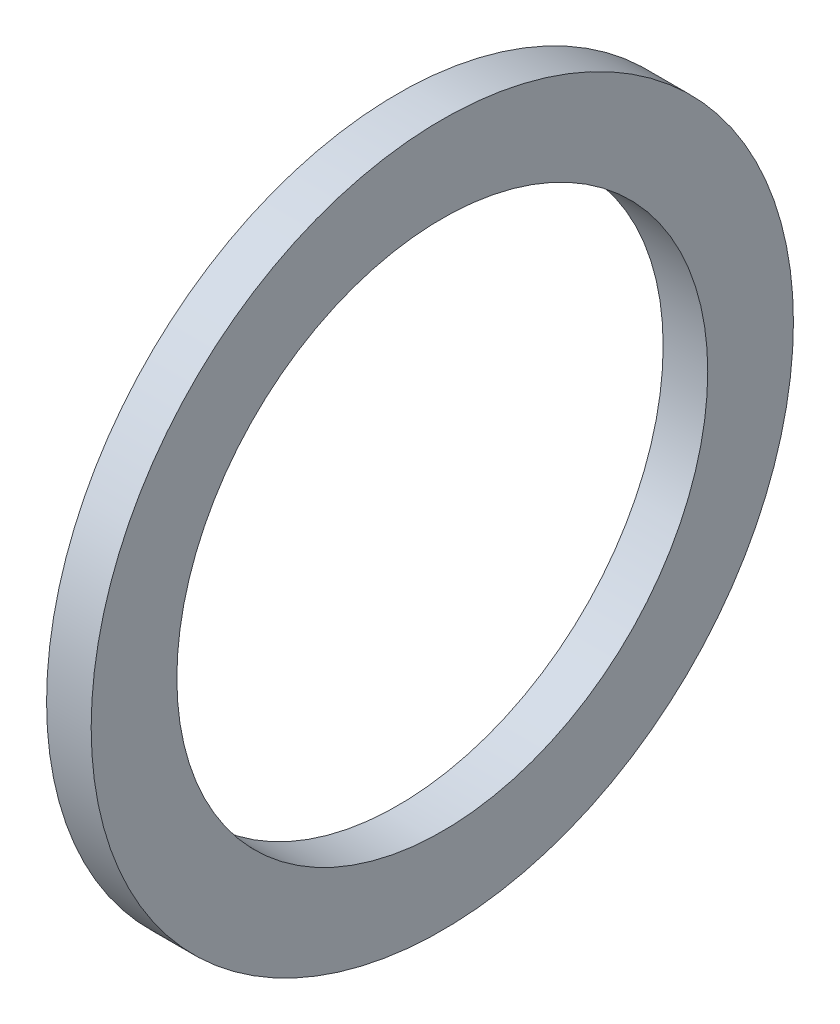
ISO-10303-21;
HEADER;
FILE_DESCRIPTION(('STEP AP214'),'2;1');
FILE_NAME('part.step','',(''),(''),'','','');
FILE_SCHEMA(('AUTOMOTIVE_DESIGN { 1 0 10303 214 1 1 1 1 }'));
ENDSEC;
DATA;
#1=APPLICATION_CONTEXT('core data for automotive mechanical design processes');
#2=APPLICATION_PROTOCOL_DEFINITION('international standard','automotive_design',2000,#1);
#3=PRODUCT_CONTEXT('',#1,'mechanical');
#4=PRODUCT('Part','Part','',(#3));
#5=PRODUCT_RELATED_PRODUCT_CATEGORY('part','',(#4));
#6=PRODUCT_DEFINITION_FORMATION('','',#4);
#7=PRODUCT_DEFINITION_CONTEXT('part definition',#1,'design');
#8=PRODUCT_DEFINITION('design','',#6,#7);
#9=PRODUCT_DEFINITION_SHAPE('','',#8);
#10=(LENGTH_UNIT() NAMED_UNIT(*) SI_UNIT(.MILLI.,.METRE.));
#11=(NAMED_UNIT(*) PLANE_ANGLE_UNIT() SI_UNIT($,.RADIAN.));
#12=(NAMED_UNIT(*) SI_UNIT($,.STERADIAN.) SOLID_ANGLE_UNIT());
#13=UNCERTAINTY_MEASURE_WITH_UNIT(LENGTH_MEASURE(1.E-05),#10,'distance_accuracy_value','');
#14=(GEOMETRIC_REPRESENTATION_CONTEXT(3) GLOBAL_UNCERTAINTY_ASSIGNED_CONTEXT((#13)) GLOBAL_UNIT_ASSIGNED_CONTEXT((#10,
#11,#12)) REPRESENTATION_CONTEXT('',''));
#15=CARTESIAN_POINT('',(0.,0.,0.));
#16=DIRECTION('',(0.,0.,1.));
#17=DIRECTION('',(1.,0.,0.));
#18=AXIS2_PLACEMENT_3D('',#15,#16,#17);
#19=CARTESIAN_POINT('',(3.175,0.,0.));
#20=DIRECTION('',(1.,0.,0.));
#21=DIRECTION('',(0.,0.,-1.));
#22=AXIS2_PLACEMENT_3D('',#19,#20,#21);
#23=PLANE('',#22);
#24=CARTESIAN_POINT('',(3.175,0.,0.));
#25=DIRECTION('',(1.,0.,0.));
#26=DIRECTION('',(0.,0.,-1.));
#27=AXIS2_PLACEMENT_3D('',#24,#25,#26);
#28=CIRCLE('',#27,25.);
#29=CARTESIAN_POINT('',(3.175,0.,-25.));
#30=VERTEX_POINT('',#29);
#31=EDGE_CURVE('E11',#30,#30,#28,.T.);
#32=ORIENTED_EDGE('',*,*,#31,.T.);
#33=EDGE_LOOP('',(#32));
#34=FACE_BOUND('',#33,.T.);
#35=CARTESIAN_POINT('',(3.175,0.,0.));
#36=DIRECTION('',(1.,0.,0.));
#37=DIRECTION('',(0.,0.,-1.));
#38=AXIS2_PLACEMENT_3D('',#35,#36,#37);
#39=CIRCLE('',#38,18.9);
#40=CARTESIAN_POINT('',(3.175,0.,-18.9));
#41=VERTEX_POINT('',#40);
#42=EDGE_CURVE('E42',#41,#41,#39,.T.);
#43=ORIENTED_EDGE('',*,*,#42,.F.);
#44=EDGE_LOOP('',(#43));
#45=FACE_BOUND('',#44,.T.);
#46=ADVANCED_FACE('F31',(#34,#45),#23,.T.);
#47=CARTESIAN_POINT('',(0.,0.,0.));
#48=DIRECTION('',(1.,0.,0.));
#49=DIRECTION('',(0.,0.,-1.));
#50=AXIS2_PLACEMENT_3D('',#47,#48,#49);
#51=PLANE('',#50);
#52=CARTESIAN_POINT('',(0.,0.,0.));
#53=DIRECTION('',(1.,0.,0.));
#54=DIRECTION('',(0.,0.,-1.));
#55=AXIS2_PLACEMENT_3D('',#52,#53,#54);
#56=CIRCLE('',#55,25.);
#57=CARTESIAN_POINT('',(0.,0.,-25.));
#58=VERTEX_POINT('',#57);
#59=EDGE_CURVE('E35',#58,#58,#56,.T.);
#60=ORIENTED_EDGE('',*,*,#59,.F.);
#61=EDGE_LOOP('',(#60));
#62=FACE_BOUND('',#61,.T.);
#63=CARTESIAN_POINT('',(0.,0.,0.));
#64=DIRECTION('',(1.,0.,0.));
#65=DIRECTION('',(0.,0.,-1.));
#66=AXIS2_PLACEMENT_3D('',#63,#64,#65);
#67=CIRCLE('',#66,18.9);
#68=CARTESIAN_POINT('',(0.,0.,-18.9));
#69=VERTEX_POINT('',#68);
#70=EDGE_CURVE('E45',#69,#69,#67,.T.);
#71=ORIENTED_EDGE('',*,*,#70,.T.);
#72=EDGE_LOOP('',(#71));
#73=FACE_BOUND('',#72,.T.);
#74=ADVANCED_FACE('F55',(#62,#73),#51,.F.);
#75=CARTESIAN_POINT('',(3.175,0.,0.));
#76=DIRECTION('',(-1.,0.,0.));
#77=DIRECTION('',(0.,0.,1.));
#78=AXIS2_PLACEMENT_3D('',#75,#76,#77);
#79=CYLINDRICAL_SURFACE('',#78,25.);
#80=ORIENTED_EDGE('',*,*,#31,.F.);
#81=EDGE_LOOP('',(#80));
#82=FACE_BOUND('',#81,.T.);
#83=ORIENTED_EDGE('',*,*,#59,.T.);
#84=EDGE_LOOP('',(#83));
#85=FACE_BOUND('',#84,.T.);
#86=ADVANCED_FACE('F33',(#82,#85),#79,.T.);
#87=CARTESIAN_POINT('',(3.175,0.,0.));
#88=DIRECTION('',(-1.,0.,0.));
#89=DIRECTION('',(0.,0.,1.));
#90=AXIS2_PLACEMENT_3D('',#87,#88,#89);
#91=CYLINDRICAL_SURFACE('',#90,18.9);
#92=ORIENTED_EDGE('',*,*,#42,.T.);
#93=EDGE_LOOP('',(#92));
#94=FACE_BOUND('',#93,.T.);
#95=ORIENTED_EDGE('',*,*,#70,.F.);
#96=EDGE_LOOP('',(#95));
#97=FACE_BOUND('',#96,.T.);
#98=ADVANCED_FACE('F51',(#94,#97),#91,.F.);
#99=CLOSED_SHELL('',(#46,#74,#86,#98));
#100=MANIFOLD_SOLID_BREP('B2',#99);
#101=ADVANCED_BREP_SHAPE_REPRESENTATION('',(#18,#100),#14);
#102=SHAPE_DEFINITION_REPRESENTATION(#9,#101);
ENDSEC;
END-ISO-10303-21;
